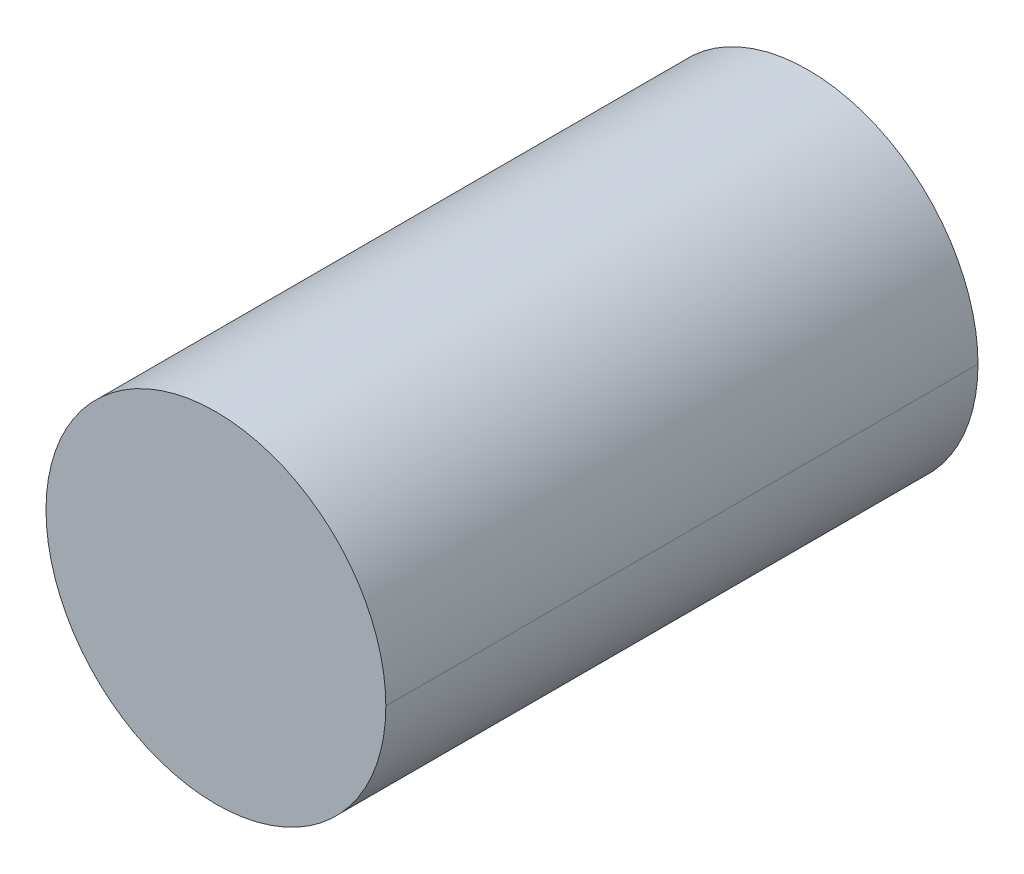
ISO-10303-21;
HEADER;
FILE_DESCRIPTION(('STEP AP214'),'2;1');
FILE_NAME('part.step','',(''),(''),'','','');
FILE_SCHEMA(('AUTOMOTIVE_DESIGN { 1 0 10303 214 1 1 1 1 }'));
ENDSEC;
DATA;
#1=APPLICATION_CONTEXT('core data for automotive mechanical design processes');
#2=APPLICATION_PROTOCOL_DEFINITION('international standard','automotive_design',2000,#1);
#3=PRODUCT_CONTEXT('',#1,'mechanical');
#4=PRODUCT('Part','Part','',(#3));
#5=PRODUCT_RELATED_PRODUCT_CATEGORY('part','',(#4));
#6=PRODUCT_DEFINITION_FORMATION('','',#4);
#7=PRODUCT_DEFINITION_CONTEXT('part definition',#1,'design');
#8=PRODUCT_DEFINITION('design','',#6,#7);
#9=PRODUCT_DEFINITION_SHAPE('','',#8);
#10=(LENGTH_UNIT() NAMED_UNIT(*) SI_UNIT(.MILLI.,.METRE.));
#11=(NAMED_UNIT(*) PLANE_ANGLE_UNIT() SI_UNIT($,.RADIAN.));
#12=(NAMED_UNIT(*) SI_UNIT($,.STERADIAN.) SOLID_ANGLE_UNIT());
#13=UNCERTAINTY_MEASURE_WITH_UNIT(LENGTH_MEASURE(1.E-05),#10,'distance_accuracy_value','');
#14=(GEOMETRIC_REPRESENTATION_CONTEXT(3) GLOBAL_UNCERTAINTY_ASSIGNED_CONTEXT((#13)) GLOBAL_UNIT_ASSIGNED_CONTEXT((#10,
#11,#12)) REPRESENTATION_CONTEXT('',''));
#15=CARTESIAN_POINT('',(0.,0.,0.));
#16=DIRECTION('',(0.,0.,1.));
#17=DIRECTION('',(1.,0.,0.));
#18=AXIS2_PLACEMENT_3D('',#15,#16,#17);
#19=CARTESIAN_POINT('',(0.,0.,0.));
#20=DIRECTION('',(0.,0.,1.));
#21=DIRECTION('',(1.,0.,0.));
#22=AXIS2_PLACEMENT_3D('',#19,#20,#21);
#23=PLANE('',#22);
#24=CARTESIAN_POINT('',(0.,0.,0.));
#25=DIRECTION('',(0.,0.,1.));
#26=DIRECTION('',(1.,0.,0.));
#27=AXIS2_PLACEMENT_3D('',#24,#25,#26);
#28=CIRCLE('',#27,6.6);
#29=CARTESIAN_POINT('',(-6.6,0.,0.));
#30=VERTEX_POINT('',#29);
#31=CARTESIAN_POINT('',(6.6,0.,0.));
#32=VERTEX_POINT('',#31);
#33=EDGE_CURVE('E9',#30,#32,#28,.T.);
#34=ORIENTED_EDGE('',*,*,#33,.F.);
#35=CARTESIAN_POINT('',(0.,0.,0.));
#36=DIRECTION('',(0.,0.,1.));
#37=DIRECTION('',(1.,0.,0.));
#38=AXIS2_PLACEMENT_3D('',#35,#36,#37);
#39=CIRCLE('',#38,6.6);
#40=EDGE_CURVE('E64',#32,#30,#39,.T.);
#41=ORIENTED_EDGE('',*,*,#40,.F.);
#42=EDGE_LOOP('',(#34,#41));
#43=FACE_BOUND('',#42,.T.);
#44=ADVANCED_FACE('F14',(#43),#23,.F.);
#45=CARTESIAN_POINT('',(0.,0.,23.));
#46=DIRECTION('',(0.,0.,1.));
#47=DIRECTION('',(1.,0.,0.));
#48=AXIS2_PLACEMENT_3D('',#45,#46,#47);
#49=PLANE('',#48);
#50=CARTESIAN_POINT('',(0.,0.,23.));
#51=DIRECTION('',(0.,0.,1.));
#52=DIRECTION('',(1.,0.,0.));
#53=AXIS2_PLACEMENT_3D('',#50,#51,#52);
#54=CIRCLE('',#53,6.6);
#55=CARTESIAN_POINT('',(-6.6,0.,23.));
#56=VERTEX_POINT('',#55);
#57=CARTESIAN_POINT('',(6.6,0.,23.));
#58=VERTEX_POINT('',#57);
#59=EDGE_CURVE('E23',#56,#58,#54,.T.);
#60=ORIENTED_EDGE('',*,*,#59,.T.);
#61=CARTESIAN_POINT('',(0.,0.,23.));
#62=DIRECTION('',(0.,0.,1.));
#63=DIRECTION('',(1.,0.,0.));
#64=AXIS2_PLACEMENT_3D('',#61,#62,#63);
#65=CIRCLE('',#64,6.6);
#66=EDGE_CURVE('E54',#58,#56,#65,.T.);
#67=ORIENTED_EDGE('',*,*,#66,.T.);
#68=EDGE_LOOP('',(#60,#67));
#69=FACE_BOUND('',#68,.T.);
#70=ADVANCED_FACE('F52',(#69),#49,.T.);
#71=CARTESIAN_POINT('',(0.,0.,23.));
#72=DIRECTION('',(0.,0.,-1.));
#73=DIRECTION('',(-1.,0.,0.));
#74=AXIS2_PLACEMENT_3D('',#71,#72,#73);
#75=CYLINDRICAL_SURFACE('',#74,6.6);
#76=DIRECTION('',(0.,0.,-1.));
#77=VECTOR('',#76,1.);
#78=CARTESIAN_POINT('',(6.6,0.,23.));
#79=LINE('',#78,#77);
#80=EDGE_CURVE('E59',#58,#32,#79,.T.);
#81=ORIENTED_EDGE('',*,*,#80,.F.);
#82=ORIENTED_EDGE('',*,*,#59,.F.);
#83=DIRECTION('',(0.,0.,-1.));
#84=VECTOR('',#83,1.);
#85=CARTESIAN_POINT('',(-6.6,0.,23.));
#86=LINE('',#85,#84);
#87=EDGE_CURVE('E57',#56,#30,#86,.T.);
#88=ORIENTED_EDGE('',*,*,#87,.T.);
#89=ORIENTED_EDGE('',*,*,#33,.T.);
#90=EDGE_LOOP('',(#81,#82,#88,#89));
#91=FACE_BOUND('',#90,.T.);
#92=ADVANCED_FACE('F60',(#91),#75,.T.);
#93=CARTESIAN_POINT('',(0.,0.,23.));
#94=DIRECTION('',(0.,0.,-1.));
#95=DIRECTION('',(-1.,0.,0.));
#96=AXIS2_PLACEMENT_3D('',#93,#94,#95);
#97=CYLINDRICAL_SURFACE('',#96,6.6);
#98=ORIENTED_EDGE('',*,*,#66,.F.);
#99=ORIENTED_EDGE('',*,*,#80,.T.);
#100=ORIENTED_EDGE('',*,*,#40,.T.);
#101=ORIENTED_EDGE('',*,*,#87,.F.);
#102=EDGE_LOOP('',(#98,#99,#100,#101));
#103=FACE_BOUND('',#102,.T.);
#104=ADVANCED_FACE('F16',(#103),#97,.T.);
#105=CLOSED_SHELL('',(#44,#70,#92,#104));
#106=MANIFOLD_SOLID_BREP('B1',#105);
#107=ADVANCED_BREP_SHAPE_REPRESENTATION('',(#18,#106),#14);
#108=SHAPE_DEFINITION_REPRESENTATION(#9,#107);
ENDSEC;
END-ISO-10303-21;
